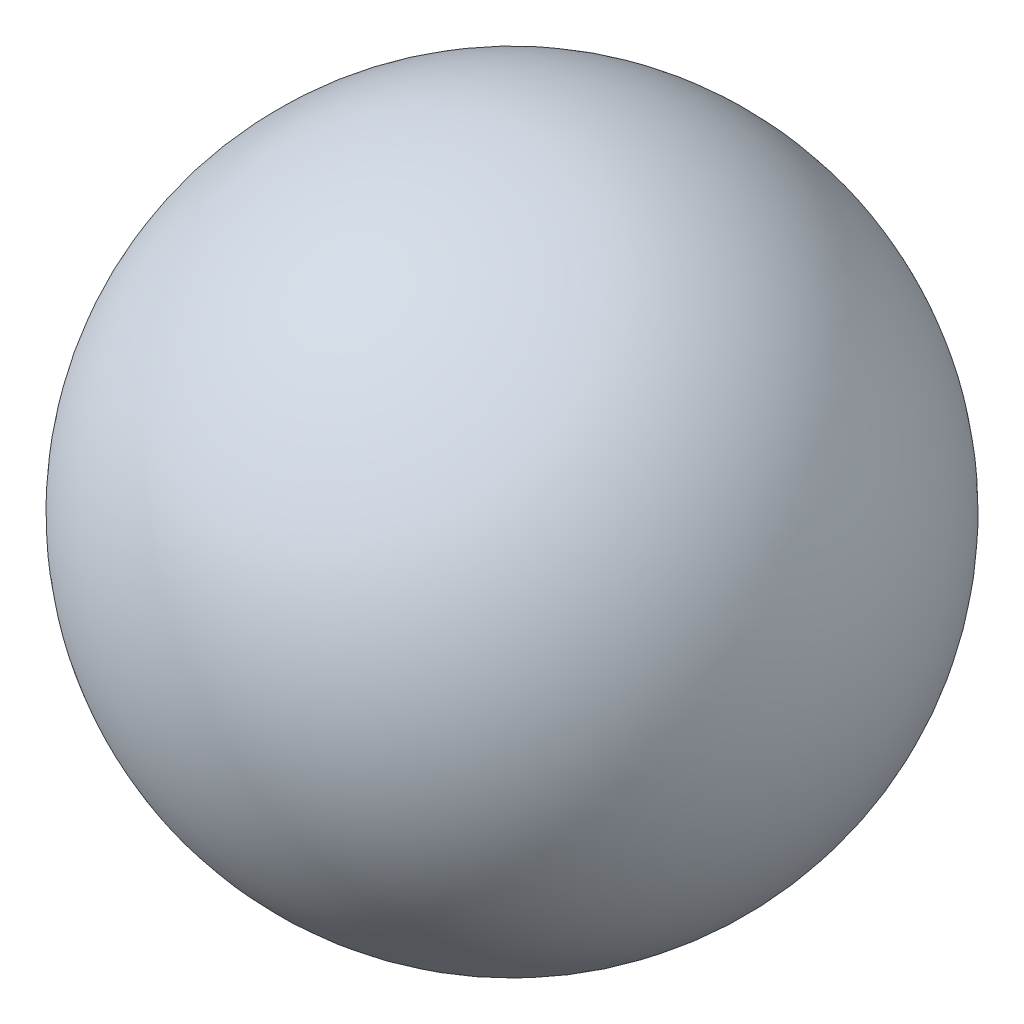
ISO-10303-21;
HEADER;
FILE_DESCRIPTION(('STEP AP214'),'2;1');
FILE_NAME('part.step','',(''),(''),'','','');
FILE_SCHEMA(('AUTOMOTIVE_DESIGN { 1 0 10303 214 1 1 1 1 }'));
ENDSEC;
DATA;
#1=APPLICATION_CONTEXT('core data for automotive mechanical design processes');
#2=APPLICATION_PROTOCOL_DEFINITION('international standard','automotive_design',2000,#1);
#3=PRODUCT_CONTEXT('',#1,'mechanical');
#4=PRODUCT('Part','Part','',(#3));
#5=PRODUCT_RELATED_PRODUCT_CATEGORY('part','',(#4));
#6=PRODUCT_DEFINITION_FORMATION('','',#4);
#7=PRODUCT_DEFINITION_CONTEXT('part definition',#1,'design');
#8=PRODUCT_DEFINITION('design','',#6,#7);
#9=PRODUCT_DEFINITION_SHAPE('','',#8);
#10=(LENGTH_UNIT() NAMED_UNIT(*) SI_UNIT(.MILLI.,.METRE.));
#11=(NAMED_UNIT(*) PLANE_ANGLE_UNIT() SI_UNIT($,.RADIAN.));
#12=(NAMED_UNIT(*) SI_UNIT($,.STERADIAN.) SOLID_ANGLE_UNIT());
#13=UNCERTAINTY_MEASURE_WITH_UNIT(LENGTH_MEASURE(1.E-05),#10,'distance_accuracy_value','');
#14=(GEOMETRIC_REPRESENTATION_CONTEXT(3) GLOBAL_UNCERTAINTY_ASSIGNED_CONTEXT((#13)) GLOBAL_UNIT_ASSIGNED_CONTEXT((#10,
#11,#12)) REPRESENTATION_CONTEXT('',''));
#15=CARTESIAN_POINT('',(0.,0.,0.));
#16=DIRECTION('',(0.,0.,1.));
#17=DIRECTION('',(1.,0.,0.));
#18=AXIS2_PLACEMENT_3D('',#15,#16,#17);
#19=CARTESIAN_POINT('',(0.,-3.,8.));
#20=DIRECTION('',(0.,0.,1.));
#21=DIRECTION('',(1.,0.,0.));
#22=AXIS2_PLACEMENT_3D('',#19,#20,#21);
#23=SPHERICAL_SURFACE('',#22,1.8);
#24=CARTESIAN_POINT('',(0.,-3.,9.8));
#25=VERTEX_POINT('',#24);
#26=VERTEX_LOOP('',#25);
#27=FACE_BOUND('',#26,.T.);
#28=ADVANCED_FACE('F12',(#27),#23,.T.);
#29=CLOSED_SHELL('',(#28));
#30=MANIFOLD_SOLID_BREP('B1',#29);
#31=ADVANCED_BREP_SHAPE_REPRESENTATION('',(#18,#30),#14);
#32=SHAPE_DEFINITION_REPRESENTATION(#9,#31);
ENDSEC;
END-ISO-10303-21;
